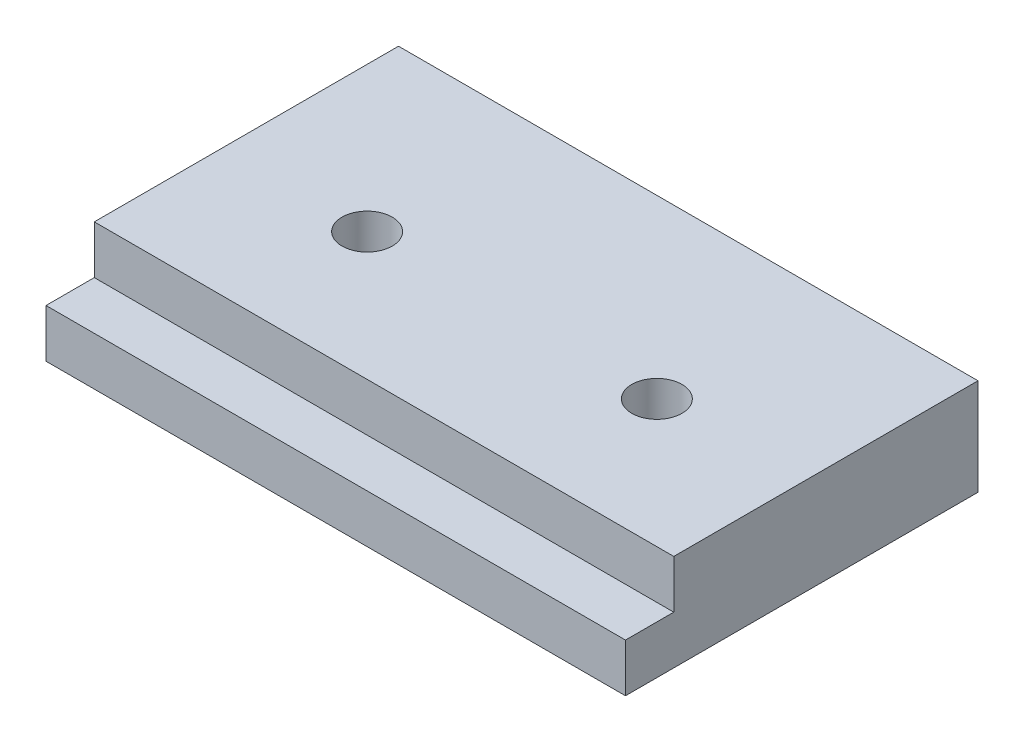
ISO-10303-21;
HEADER;
FILE_DESCRIPTION(('STEP AP214'),'2;1');
FILE_NAME('part.step','',(''),(''),'','','');
FILE_SCHEMA(('AUTOMOTIVE_DESIGN { 1 0 10303 214 1 1 1 1 }'));
ENDSEC;
DATA;
#1=APPLICATION_CONTEXT('core data for automotive mechanical design processes');
#2=APPLICATION_PROTOCOL_DEFINITION('international standard','automotive_design',2000,#1);
#3=PRODUCT_CONTEXT('',#1,'mechanical');
#4=PRODUCT('Part','Part','',(#3));
#5=PRODUCT_RELATED_PRODUCT_CATEGORY('part','',(#4));
#6=PRODUCT_DEFINITION_FORMATION('','',#4);
#7=PRODUCT_DEFINITION_CONTEXT('part definition',#1,'design');
#8=PRODUCT_DEFINITION('design','',#6,#7);
#9=PRODUCT_DEFINITION_SHAPE('','',#8);
#10=(LENGTH_UNIT() NAMED_UNIT(*) SI_UNIT(.MILLI.,.METRE.));
#11=(NAMED_UNIT(*) PLANE_ANGLE_UNIT() SI_UNIT($,.RADIAN.));
#12=(NAMED_UNIT(*) SI_UNIT($,.STERADIAN.) SOLID_ANGLE_UNIT());
#13=UNCERTAINTY_MEASURE_WITH_UNIT(LENGTH_MEASURE(1.E-05),#10,'distance_accuracy_value','');
#14=(GEOMETRIC_REPRESENTATION_CONTEXT(3) GLOBAL_UNCERTAINTY_ASSIGNED_CONTEXT((#13)) GLOBAL_UNIT_ASSIGNED_CONTEXT((#10,
#11,#12)) REPRESENTATION_CONTEXT('',''));
#15=CARTESIAN_POINT('',(0.,0.,0.));
#16=DIRECTION('',(0.,0.,1.));
#17=DIRECTION('',(1.,0.,0.));
#18=AXIS2_PLACEMENT_3D('',#15,#16,#17);
#19=CARTESIAN_POINT('',(30.,10.,18.25));
#20=DIRECTION('',(-1.,0.,0.));
#21=DIRECTION('',(0.,0.,1.));
#22=AXIS2_PLACEMENT_3D('',#19,#20,#21);
#23=PLANE('',#22);
#24=DIRECTION('',(0.,0.,-1.));
#25=VECTOR('',#24,1.);
#26=CARTESIAN_POINT('',(30.,10.,18.25));
#27=LINE('',#26,#25);
#28=CARTESIAN_POINT('',(30.,10.,13.25));
#29=VERTEX_POINT('',#28);
#30=CARTESIAN_POINT('',(30.,10.,-18.25));
#31=VERTEX_POINT('',#30);
#32=EDGE_CURVE('E107',#29,#31,#27,.T.);
#33=ORIENTED_EDGE('',*,*,#32,.F.);
#34=DIRECTION('',(0.,1.,0.));
#35=VECTOR('',#34,1.);
#36=CARTESIAN_POINT('',(30.,5.,13.25));
#37=LINE('',#36,#35);
#38=CARTESIAN_POINT('',(30.,5.,13.25));
#39=VERTEX_POINT('',#38);
#40=EDGE_CURVE('E55',#39,#29,#37,.T.);
#41=ORIENTED_EDGE('',*,*,#40,.F.);
#42=DIRECTION('',(0.,0.,-1.));
#43=VECTOR('',#42,1.);
#44=CARTESIAN_POINT('',(30.,5.,18.25));
#45=LINE('',#44,#43);
#46=CARTESIAN_POINT('',(30.,5.,18.25));
#47=VERTEX_POINT('',#46);
#48=EDGE_CURVE('E92',#47,#39,#45,.T.);
#49=ORIENTED_EDGE('',*,*,#48,.F.);
#50=DIRECTION('',(0.,-1.,0.));
#51=VECTOR('',#50,1.);
#52=CARTESIAN_POINT('',(30.,10.,18.25));
#53=LINE('',#52,#51);
#54=CARTESIAN_POINT('',(30.,0.,18.25));
#55=VERTEX_POINT('',#54);
#56=EDGE_CURVE('E84',#47,#55,#53,.T.);
#57=ORIENTED_EDGE('',*,*,#56,.T.);
#58=DIRECTION('',(0.,0.,-1.));
#59=VECTOR('',#58,1.);
#60=CARTESIAN_POINT('',(30.,0.,18.25));
#61=LINE('',#60,#59);
#62=CARTESIAN_POINT('',(30.,0.,-18.25));
#63=VERTEX_POINT('',#62);
#64=EDGE_CURVE('E89',#55,#63,#61,.T.);
#65=ORIENTED_EDGE('',*,*,#64,.T.);
#66=DIRECTION('',(0.,-1.,0.));
#67=VECTOR('',#66,1.);
#68=CARTESIAN_POINT('',(30.,10.,-18.25));
#69=LINE('',#68,#67);
#70=EDGE_CURVE('E11',#31,#63,#69,.T.);
#71=ORIENTED_EDGE('',*,*,#70,.F.);
#72=EDGE_LOOP('',(#33,#41,#49,#57,#65,#71));
#73=FACE_BOUND('',#72,.T.);
#74=ADVANCED_FACE('F39',(#73),#23,.F.);
#75=CARTESIAN_POINT('',(-30.,10.,-18.25));
#76=DIRECTION('',(0.,0.,1.));
#77=DIRECTION('',(1.,0.,0.));
#78=AXIS2_PLACEMENT_3D('',#75,#76,#77);
#79=PLANE('',#78);
#80=DIRECTION('',(-1.,0.,0.));
#81=VECTOR('',#80,1.);
#82=CARTESIAN_POINT('',(-30.,0.,-18.25));
#83=LINE('',#82,#81);
#84=CARTESIAN_POINT('',(-30.,0.,-18.25));
#85=VERTEX_POINT('',#84);
#86=EDGE_CURVE('E111',#63,#85,#83,.T.);
#87=ORIENTED_EDGE('',*,*,#86,.T.);
#88=DIRECTION('',(0.,-1.,0.));
#89=VECTOR('',#88,1.);
#90=CARTESIAN_POINT('',(-30.,10.,-18.25));
#91=LINE('',#90,#89);
#92=CARTESIAN_POINT('',(-30.,10.,-18.25));
#93=VERTEX_POINT('',#92);
#94=EDGE_CURVE('E48',#93,#85,#91,.T.);
#95=ORIENTED_EDGE('',*,*,#94,.F.);
#96=DIRECTION('',(-1.,0.,0.));
#97=VECTOR('',#96,1.);
#98=CARTESIAN_POINT('',(-30.,10.,-18.25));
#99=LINE('',#98,#97);
#100=EDGE_CURVE('E64',#31,#93,#99,.T.);
#101=ORIENTED_EDGE('',*,*,#100,.F.);
#102=ORIENTED_EDGE('',*,*,#70,.T.);
#103=EDGE_LOOP('',(#87,#95,#101,#102));
#104=FACE_BOUND('',#103,.T.);
#105=ADVANCED_FACE('F134',(#104),#79,.F.);
#106=CARTESIAN_POINT('',(-30.,10.,18.25));
#107=DIRECTION('',(1.,0.,0.));
#108=DIRECTION('',(0.,0.,-1.));
#109=AXIS2_PLACEMENT_3D('',#106,#107,#108);
#110=PLANE('',#109);
#111=DIRECTION('',(0.,0.,1.));
#112=VECTOR('',#111,1.);
#113=CARTESIAN_POINT('',(-30.,5.,18.25));
#114=LINE('',#113,#112);
#115=CARTESIAN_POINT('',(-30.,5.,13.25));
#116=VERTEX_POINT('',#115);
#117=CARTESIAN_POINT('',(-30.,5.,18.25));
#118=VERTEX_POINT('',#117);
#119=EDGE_CURVE('E146',#116,#118,#114,.T.);
#120=ORIENTED_EDGE('',*,*,#119,.F.);
#121=DIRECTION('',(0.,1.,0.));
#122=VECTOR('',#121,1.);
#123=CARTESIAN_POINT('',(-30.,5.,13.25));
#124=LINE('',#123,#122);
#125=CARTESIAN_POINT('',(-30.,10.,13.25));
#126=VERTEX_POINT('',#125);
#127=EDGE_CURVE('E113',#116,#126,#124,.T.);
#128=ORIENTED_EDGE('',*,*,#127,.T.);
#129=DIRECTION('',(0.,0.,1.));
#130=VECTOR('',#129,1.);
#131=CARTESIAN_POINT('',(-30.,10.,18.25));
#132=LINE('',#131,#130);
#133=EDGE_CURVE('E97',#93,#126,#132,.T.);
#134=ORIENTED_EDGE('',*,*,#133,.F.);
#135=ORIENTED_EDGE('',*,*,#94,.T.);
#136=DIRECTION('',(0.,0.,1.));
#137=VECTOR('',#136,1.);
#138=CARTESIAN_POINT('',(-30.,0.,18.25));
#139=LINE('',#138,#137);
#140=CARTESIAN_POINT('',(-30.,0.,18.25));
#141=VERTEX_POINT('',#140);
#142=EDGE_CURVE('E108',#85,#141,#139,.T.);
#143=ORIENTED_EDGE('',*,*,#142,.T.);
#144=DIRECTION('',(0.,-1.,0.));
#145=VECTOR('',#144,1.);
#146=CARTESIAN_POINT('',(-30.,10.,18.25));
#147=LINE('',#146,#145);
#148=EDGE_CURVE('E96',#118,#141,#147,.T.);
#149=ORIENTED_EDGE('',*,*,#148,.F.);
#150=EDGE_LOOP('',(#120,#128,#134,#135,#143,#149));
#151=FACE_BOUND('',#150,.T.);
#152=ADVANCED_FACE('F132',(#151),#110,.F.);
#153=CARTESIAN_POINT('',(-30.,10.,18.25));
#154=DIRECTION('',(0.,0.,-1.));
#155=DIRECTION('',(-1.,0.,0.));
#156=AXIS2_PLACEMENT_3D('',#153,#154,#155);
#157=PLANE('',#156);
#158=ORIENTED_EDGE('',*,*,#56,.F.);
#159=DIRECTION('',(1.,0.,0.));
#160=VECTOR('',#159,1.);
#161=CARTESIAN_POINT('',(-30.,5.,18.25));
#162=LINE('',#161,#160);
#163=EDGE_CURVE('E153',#118,#47,#162,.T.);
#164=ORIENTED_EDGE('',*,*,#163,.F.);
#165=ORIENTED_EDGE('',*,*,#148,.T.);
#166=DIRECTION('',(1.,0.,0.));
#167=VECTOR('',#166,1.);
#168=CARTESIAN_POINT('',(-30.,0.,18.25));
#169=LINE('',#168,#167);
#170=EDGE_CURVE('E100',#141,#55,#169,.T.);
#171=ORIENTED_EDGE('',*,*,#170,.T.);
#172=EDGE_LOOP('',(#158,#164,#165,#171));
#173=FACE_BOUND('',#172,.T.);
#174=ADVANCED_FACE('F101',(#173),#157,.F.);
#175=CARTESIAN_POINT('',(0.,10.,0.));
#176=DIRECTION('',(0.,-1.,0.));
#177=DIRECTION('',(0.,0.,-1.));
#178=AXIS2_PLACEMENT_3D('',#175,#176,#177);
#179=PLANE('',#178);
#180=CARTESIAN_POINT('',(-15.,10.,0.));
#181=DIRECTION('',(0.,1.,0.));
#182=DIRECTION('',(0.,0.,1.));
#183=AXIS2_PLACEMENT_3D('',#180,#181,#182);
#184=CIRCLE('',#183,2.59999999999999);
#185=CARTESIAN_POINT('',(-15.,10.,2.59999999999999));
#186=VERTEX_POINT('',#185);
#187=EDGE_CURVE('E167',#186,#186,#184,.T.);
#188=ORIENTED_EDGE('',*,*,#187,.F.);
#189=EDGE_LOOP('',(#188));
#190=FACE_BOUND('',#189,.T.);
#191=CARTESIAN_POINT('',(15.,10.,0.));
#192=DIRECTION('',(0.,1.,0.));
#193=DIRECTION('',(0.,0.,1.));
#194=AXIS2_PLACEMENT_3D('',#191,#192,#193);
#195=CIRCLE('',#194,2.59999999999999);
#196=CARTESIAN_POINT('',(15.,10.,2.59999999999999));
#197=VERTEX_POINT('',#196);
#198=EDGE_CURVE('E163',#197,#197,#195,.T.);
#199=ORIENTED_EDGE('',*,*,#198,.F.);
#200=EDGE_LOOP('',(#199));
#201=FACE_BOUND('',#200,.T.);
#202=ORIENTED_EDGE('',*,*,#133,.T.);
#203=DIRECTION('',(-1.,0.,0.));
#204=VECTOR('',#203,1.);
#205=CARTESIAN_POINT('',(-30.,10.,13.25));
#206=LINE('',#205,#204);
#207=EDGE_CURVE('E143',#29,#126,#206,.T.);
#208=ORIENTED_EDGE('',*,*,#207,.F.);
#209=ORIENTED_EDGE('',*,*,#32,.T.);
#210=ORIENTED_EDGE('',*,*,#100,.T.);
#211=EDGE_LOOP('',(#202,#208,#209,#210));
#212=FACE_BOUND('',#211,.T.);
#213=ADVANCED_FACE('F181',(#190,#201,#212),#179,.F.);
#214=CARTESIAN_POINT('',(0.,0.,0.));
#215=DIRECTION('',(0.,-1.,0.));
#216=DIRECTION('',(0.,0.,-1.));
#217=AXIS2_PLACEMENT_3D('',#214,#215,#216);
#218=PLANE('',#217);
#219=CARTESIAN_POINT('',(-15.,0.,0.));
#220=DIRECTION('',(0.,-1.,0.));
#221=DIRECTION('',(0.,0.,-1.));
#222=AXIS2_PLACEMENT_3D('',#219,#220,#221);
#223=CIRCLE('',#222,2.59999999999999);
#224=CARTESIAN_POINT('',(-15.,0.,-2.59999999999998));
#225=VERTEX_POINT('',#224);
#226=EDGE_CURVE('E42',#225,#225,#223,.T.);
#227=ORIENTED_EDGE('',*,*,#226,.F.);
#228=EDGE_LOOP('',(#227));
#229=FACE_BOUND('',#228,.T.);
#230=CARTESIAN_POINT('',(15.,0.,0.));
#231=DIRECTION('',(0.,-1.,0.));
#232=DIRECTION('',(0.,0.,-1.));
#233=AXIS2_PLACEMENT_3D('',#230,#231,#232);
#234=CIRCLE('',#233,2.59999999999999);
#235=CARTESIAN_POINT('',(15.,0.,-2.59999999999999));
#236=VERTEX_POINT('',#235);
#237=EDGE_CURVE('E147',#236,#236,#234,.T.);
#238=ORIENTED_EDGE('',*,*,#237,.F.);
#239=EDGE_LOOP('',(#238));
#240=FACE_BOUND('',#239,.T.);
#241=ORIENTED_EDGE('',*,*,#64,.F.);
#242=ORIENTED_EDGE('',*,*,#170,.F.);
#243=ORIENTED_EDGE('',*,*,#142,.F.);
#244=ORIENTED_EDGE('',*,*,#86,.F.);
#245=EDGE_LOOP('',(#241,#242,#243,#244));
#246=FACE_BOUND('',#245,.T.);
#247=ADVANCED_FACE('F110',(#229,#240,#246),#218,.T.);
#248=CARTESIAN_POINT('',(-30.,5.,13.25));
#249=DIRECTION('',(0.,0.,-1.));
#250=DIRECTION('',(-1.,0.,0.));
#251=AXIS2_PLACEMENT_3D('',#248,#249,#250);
#252=PLANE('',#251);
#253=ORIENTED_EDGE('',*,*,#207,.T.);
#254=ORIENTED_EDGE('',*,*,#127,.F.);
#255=DIRECTION('',(-1.,0.,0.));
#256=VECTOR('',#255,1.);
#257=CARTESIAN_POINT('',(-30.,5.,13.25));
#258=LINE('',#257,#256);
#259=EDGE_CURVE('E141',#39,#116,#258,.T.);
#260=ORIENTED_EDGE('',*,*,#259,.F.);
#261=ORIENTED_EDGE('',*,*,#40,.T.);
#262=EDGE_LOOP('',(#253,#254,#260,#261));
#263=FACE_BOUND('',#262,.T.);
#264=ADVANCED_FACE('F180',(#263),#252,.F.);
#265=CARTESIAN_POINT('',(0.,5.,0.));
#266=DIRECTION('',(0.,-1.,0.));
#267=DIRECTION('',(0.,0.,-1.));
#268=AXIS2_PLACEMENT_3D('',#265,#266,#267);
#269=PLANE('',#268);
#270=ORIENTED_EDGE('',*,*,#119,.T.);
#271=ORIENTED_EDGE('',*,*,#163,.T.);
#272=ORIENTED_EDGE('',*,*,#48,.T.);
#273=ORIENTED_EDGE('',*,*,#259,.T.);
#274=EDGE_LOOP('',(#270,#271,#272,#273));
#275=FACE_BOUND('',#274,.T.);
#276=ADVANCED_FACE('F188',(#275),#269,.F.);
#277=CARTESIAN_POINT('',(15.,10.,0.));
#278=DIRECTION('',(0.,1.,0.));
#279=DIRECTION('',(0.,0.,1.));
#280=AXIS2_PLACEMENT_3D('',#277,#278,#279);
#281=CYLINDRICAL_SURFACE('',#280,2.59999999999999);
#282=ORIENTED_EDGE('',*,*,#237,.T.);
#283=EDGE_LOOP('',(#282));
#284=FACE_BOUND('',#283,.T.);
#285=ORIENTED_EDGE('',*,*,#198,.T.);
#286=EDGE_LOOP('',(#285));
#287=FACE_BOUND('',#286,.T.);
#288=ADVANCED_FACE('F185',(#284,#287),#281,.F.);
#289=CARTESIAN_POINT('',(-15.,10.,0.));
#290=DIRECTION('',(0.,1.,0.));
#291=DIRECTION('',(0.,0.,1.));
#292=AXIS2_PLACEMENT_3D('',#289,#290,#291);
#293=CYLINDRICAL_SURFACE('',#292,2.59999999999999);
#294=ORIENTED_EDGE('',*,*,#226,.T.);
#295=EDGE_LOOP('',(#294));
#296=FACE_BOUND('',#295,.T.);
#297=ORIENTED_EDGE('',*,*,#187,.T.);
#298=EDGE_LOOP('',(#297));
#299=FACE_BOUND('',#298,.T.);
#300=ADVANCED_FACE('F176',(#296,#299),#293,.F.);
#301=CLOSED_SHELL('',(#74,#105,#152,#174,#213,#247,#264,#276,#288,#300));
#302=MANIFOLD_SOLID_BREP('B2',#301);
#303=ADVANCED_BREP_SHAPE_REPRESENTATION('',(#18,#302),#14);
#304=SHAPE_DEFINITION_REPRESENTATION(#9,#303);
ENDSEC;
END-ISO-10303-21;
